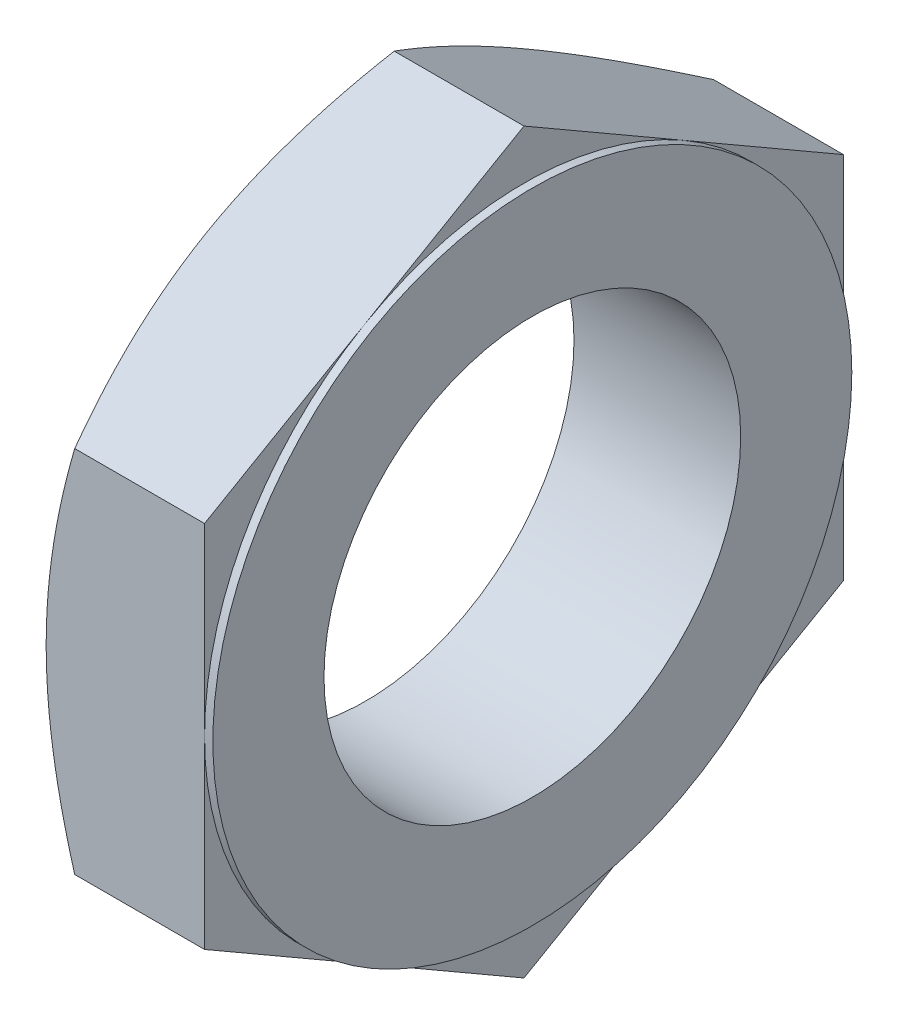
ISO-10303-21;
HEADER;
FILE_DESCRIPTION(('STEP AP214'),'2;1');
FILE_NAME('part.step','',(''),(''),'','','');
FILE_SCHEMA(('AUTOMOTIVE_DESIGN { 1 0 10303 214 1 1 1 1 }'));
ENDSEC;
DATA;
#1=APPLICATION_CONTEXT('core data for automotive mechanical design processes');
#2=APPLICATION_PROTOCOL_DEFINITION('international standard','automotive_design',2000,#1);
#3=PRODUCT_CONTEXT('',#1,'mechanical');
#4=PRODUCT('Part','Part','',(#3));
#5=PRODUCT_RELATED_PRODUCT_CATEGORY('part','',(#4));
#6=PRODUCT_DEFINITION_FORMATION('','',#4);
#7=PRODUCT_DEFINITION_CONTEXT('part definition',#1,'design');
#8=PRODUCT_DEFINITION('design','',#6,#7);
#9=PRODUCT_DEFINITION_SHAPE('','',#8);
#10=(LENGTH_UNIT() NAMED_UNIT(*) SI_UNIT(.MILLI.,.METRE.));
#11=(NAMED_UNIT(*) PLANE_ANGLE_UNIT() SI_UNIT($,.RADIAN.));
#12=(NAMED_UNIT(*) SI_UNIT($,.STERADIAN.) SOLID_ANGLE_UNIT());
#13=UNCERTAINTY_MEASURE_WITH_UNIT(LENGTH_MEASURE(1.E-05),#10,'distance_accuracy_value','');
#14=(GEOMETRIC_REPRESENTATION_CONTEXT(3) GLOBAL_UNCERTAINTY_ASSIGNED_CONTEXT((#13)) GLOBAL_UNIT_ASSIGNED_CONTEXT((#10,
#11,#12)) REPRESENTATION_CONTEXT('',''));
#15=CARTESIAN_POINT('',(0.,0.,0.));
#16=DIRECTION('',(0.,0.,1.));
#17=DIRECTION('',(1.,0.,0.));
#18=AXIS2_PLACEMENT_3D('',#15,#16,#17);
#19=CARTESIAN_POINT('',(-214.6,0.,0.));
#20=DIRECTION('',(-1.,0.,0.));
#21=DIRECTION('',(0.,0.,1.));
#22=AXIS2_PLACEMENT_3D('',#19,#20,#21);
#23=PLANE('',#22);
#24=DIRECTION('',(0.,-0.500000000000017,0.866025403784429));
#25=VECTOR('',#24,1.);
#26=CARTESIAN_POINT('',(-214.6,13.27905619136,23.));
#27=LINE('',#26,#25);
#28=CARTESIAN_POINT('',(-214.6,19.9185841370716,11.5000002597556));
#29=VERTEX_POINT('',#28);
#30=CARTESIAN_POINT('',(-214.6,26.5581123827205,2.84003214601197E-13));
#31=VERTEX_POINT('',#30);
#32=EDGE_CURVE('E108',#29,#31,#27,.F.);
#33=ORIENTED_EDGE('',*,*,#32,.F.);
#34=CARTESIAN_POINT('',(-214.6,0.,0.));
#35=DIRECTION('',(1.,0.,0.));
#36=DIRECTION('',(0.,0.,-1.));
#37=AXIS2_PLACEMENT_3D('',#34,#35,#36);
#38=CIRCLE('',#37,23.);
#39=CARTESIAN_POINT('',(-214.6,19.9185842870406,-11.5));
#40=VERTEX_POINT('',#39);
#41=EDGE_CURVE('E19',#40,#29,#38,.T.);
#42=ORIENTED_EDGE('',*,*,#41,.F.);
#43=DIRECTION('',(0.,0.500000000000017,0.866025403784429));
#44=VECTOR('',#43,1.);
#45=CARTESIAN_POINT('',(-214.6,26.55811238272,0.));
#46=LINE('',#45,#44);
#47=EDGE_CURVE('E113',#31,#40,#46,.F.);
#48=ORIENTED_EDGE('',*,*,#47,.F.);
#49=EDGE_LOOP('',(#33,#42,#48));
#50=FACE_BOUND('',#49,.T.);
#51=ADVANCED_FACE('F16',(#50),#23,.F.);
#52=CARTESIAN_POINT('',(-214.6,0.,0.));
#53=DIRECTION('',(-1.,0.,0.));
#54=DIRECTION('',(0.,0.,1.));
#55=AXIS2_PLACEMENT_3D('',#52,#53,#54);
#56=PLANE('',#55);
#57=DIRECTION('',(0.,0.500000000000017,0.866025403784429));
#58=VECTOR('',#57,1.);
#59=CARTESIAN_POINT('',(-214.6,26.55811238272,0.));
#60=LINE('',#59,#58);
#61=CARTESIAN_POINT('',(-214.6,13.2790561913595,-22.9999999999997));
#62=VERTEX_POINT('',#61);
#63=EDGE_CURVE('E111',#40,#62,#60,.F.);
#64=ORIENTED_EDGE('',*,*,#63,.F.);
#65=CARTESIAN_POINT('',(-214.6,0.,0.));
#66=DIRECTION('',(1.,0.,0.));
#67=DIRECTION('',(0.,0.,-1.));
#68=AXIS2_PLACEMENT_3D('',#65,#66,#67);
#69=CIRCLE('',#68,23.);
#70=CARTESIAN_POINT('',(-214.6,0.,-23.));
#71=VERTEX_POINT('',#70);
#72=EDGE_CURVE('E104',#71,#40,#69,.T.);
#73=ORIENTED_EDGE('',*,*,#72,.F.);
#74=DIRECTION('',(0.,1.,0.));
#75=VECTOR('',#74,1.);
#76=CARTESIAN_POINT('',(-214.6,13.27905619136,-23.));
#77=LINE('',#76,#75);
#78=EDGE_CURVE('E378',#62,#71,#77,.F.);
#79=ORIENTED_EDGE('',*,*,#78,.F.);
#80=EDGE_LOOP('',(#64,#73,#79));
#81=FACE_BOUND('',#80,.T.);
#82=ADVANCED_FACE('F281',(#81),#56,.F.);
#83=CARTESIAN_POINT('',(-214.6,0.,0.));
#84=DIRECTION('',(-1.,0.,0.));
#85=DIRECTION('',(0.,0.,1.));
#86=AXIS2_PLACEMENT_3D('',#83,#84,#85);
#87=PLANE('',#86);
#88=DIRECTION('',(0.,1.,0.));
#89=VECTOR('',#88,1.);
#90=CARTESIAN_POINT('',(-214.6,13.27905619136,-23.));
#91=LINE('',#90,#89);
#92=CARTESIAN_POINT('',(-214.6,-13.27905619136,-23.));
#93=VERTEX_POINT('',#92);
#94=EDGE_CURVE('E379',#71,#93,#91,.F.);
#95=ORIENTED_EDGE('',*,*,#94,.F.);
#96=CARTESIAN_POINT('',(-214.6,0.,0.));
#97=DIRECTION('',(1.,0.,0.));
#98=DIRECTION('',(0.,0.,-1.));
#99=AXIS2_PLACEMENT_3D('',#96,#97,#98);
#100=CIRCLE('',#99,23.);
#101=CARTESIAN_POINT('',(-214.6,-19.9185842870413,-11.5000000000004));
#102=VERTEX_POINT('',#101);
#103=EDGE_CURVE('E121',#102,#71,#100,.T.);
#104=ORIENTED_EDGE('',*,*,#103,.F.);
#105=DIRECTION('',(0.,0.500000000000017,-0.866025403784429));
#106=VECTOR('',#105,1.);
#107=CARTESIAN_POINT('',(-214.6,-13.27905619136,-23.));
#108=LINE('',#107,#106);
#109=EDGE_CURVE('E372',#93,#102,#108,.F.);
#110=ORIENTED_EDGE('',*,*,#109,.F.);
#111=EDGE_LOOP('',(#95,#104,#110));
#112=FACE_BOUND('',#111,.T.);
#113=ADVANCED_FACE('F278',(#112),#87,.F.);
#114=CARTESIAN_POINT('',(-214.6,0.,0.));
#115=DIRECTION('',(-1.,0.,0.));
#116=DIRECTION('',(0.,0.,1.));
#117=AXIS2_PLACEMENT_3D('',#114,#115,#116);
#118=PLANE('',#117);
#119=DIRECTION('',(0.,0.500000000000017,-0.866025403784429));
#120=VECTOR('',#119,1.);
#121=CARTESIAN_POINT('',(-214.6,-13.27905619136,-23.));
#122=LINE('',#121,#120);
#123=CARTESIAN_POINT('',(-214.6,-26.5581123827205,-2.84003214601197E-13));
#124=VERTEX_POINT('',#123);
#125=EDGE_CURVE('E373',#102,#124,#122,.F.);
#126=ORIENTED_EDGE('',*,*,#125,.F.);
#127=CARTESIAN_POINT('',(-214.6,0.,0.));
#128=DIRECTION('',(1.,0.,0.));
#129=DIRECTION('',(0.,0.,-1.));
#130=AXIS2_PLACEMENT_3D('',#127,#128,#129);
#131=CIRCLE('',#130,23.);
#132=CARTESIAN_POINT('',(-214.6,-19.9185842870406,11.5));
#133=VERTEX_POINT('',#132);
#134=EDGE_CURVE('E126',#133,#102,#131,.T.);
#135=ORIENTED_EDGE('',*,*,#134,.F.);
#136=DIRECTION('',(0.,-0.500000000000017,-0.866025403784429));
#137=VECTOR('',#136,1.);
#138=CARTESIAN_POINT('',(-214.6,-26.55811238272,0.));
#139=LINE('',#138,#137);
#140=EDGE_CURVE('E368',#124,#133,#139,.F.);
#141=ORIENTED_EDGE('',*,*,#140,.F.);
#142=EDGE_LOOP('',(#126,#135,#141));
#143=FACE_BOUND('',#142,.T.);
#144=ADVANCED_FACE('F275',(#143),#118,.F.);
#145=CARTESIAN_POINT('',(-214.6,0.,0.));
#146=DIRECTION('',(-1.,0.,0.));
#147=DIRECTION('',(0.,0.,1.));
#148=AXIS2_PLACEMENT_3D('',#145,#146,#147);
#149=PLANE('',#148);
#150=DIRECTION('',(0.,1.,0.));
#151=VECTOR('',#150,1.);
#152=CARTESIAN_POINT('',(-214.6,-13.27905619136,23.));
#153=LINE('',#152,#151);
#154=CARTESIAN_POINT('',(-214.6,0.,23.));
#155=VERTEX_POINT('',#154);
#156=CARTESIAN_POINT('',(-214.6,13.27905619136,23.));
#157=VERTEX_POINT('',#156);
#158=EDGE_CURVE('E100',#155,#157,#153,.T.);
#159=ORIENTED_EDGE('',*,*,#158,.F.);
#160=CARTESIAN_POINT('',(-214.6,0.,0.));
#161=DIRECTION('',(1.,0.,0.));
#162=DIRECTION('',(0.,0.,-1.));
#163=AXIS2_PLACEMENT_3D('',#160,#161,#162);
#164=CIRCLE('',#163,23.);
#165=EDGE_CURVE('E93',#29,#155,#164,.T.);
#166=ORIENTED_EDGE('',*,*,#165,.F.);
#167=DIRECTION('',(0.,-0.500000000000017,0.866025403784429));
#168=VECTOR('',#167,1.);
#169=CARTESIAN_POINT('',(-214.6,13.27905619136,23.));
#170=LINE('',#169,#168);
#171=EDGE_CURVE('E97',#157,#29,#170,.F.);
#172=ORIENTED_EDGE('',*,*,#171,.F.);
#173=EDGE_LOOP('',(#159,#166,#172));
#174=FACE_BOUND('',#173,.T.);
#175=ADVANCED_FACE('F95',(#174),#149,.F.);
#176=CARTESIAN_POINT('',(-214.6,0.,0.));
#177=DIRECTION('',(-1.,0.,0.));
#178=DIRECTION('',(0.,0.,1.));
#179=AXIS2_PLACEMENT_3D('',#176,#177,#178);
#180=PLANE('',#179);
#181=DIRECTION('',(0.,-0.500000000000017,-0.866025403784429));
#182=VECTOR('',#181,1.);
#183=CARTESIAN_POINT('',(-214.6,-26.55811238272,0.));
#184=LINE('',#183,#182);
#185=CARTESIAN_POINT('',(-214.6,-13.2790561913595,22.9999999999997));
#186=VERTEX_POINT('',#185);
#187=EDGE_CURVE('E358',#133,#186,#184,.F.);
#188=ORIENTED_EDGE('',*,*,#187,.F.);
#189=CARTESIAN_POINT('',(-214.6,0.,0.));
#190=DIRECTION('',(1.,0.,0.));
#191=DIRECTION('',(0.,0.,-1.));
#192=AXIS2_PLACEMENT_3D('',#189,#190,#191);
#193=CIRCLE('',#192,23.);
#194=EDGE_CURVE('E115',#155,#133,#193,.T.);
#195=ORIENTED_EDGE('',*,*,#194,.F.);
#196=DIRECTION('',(0.,1.,0.));
#197=VECTOR('',#196,1.);
#198=CARTESIAN_POINT('',(-214.6,-13.27905619136,23.));
#199=LINE('',#198,#197);
#200=EDGE_CURVE('E136',#186,#155,#199,.T.);
#201=ORIENTED_EDGE('',*,*,#200,.F.);
#202=EDGE_LOOP('',(#188,#195,#201));
#203=FACE_BOUND('',#202,.T.);
#204=ADVANCED_FACE('F268',(#203),#180,.F.);
#205=CARTESIAN_POINT('',(-214.6,0.,0.));
#206=DIRECTION('',(1.,0.,0.));
#207=DIRECTION('',(0.,0.,-1.));
#208=AXIS2_PLACEMENT_3D('',#205,#206,#207);
#209=CYLINDRICAL_SURFACE('',#208,23.);
#210=CARTESIAN_POINT('',(-214.,0.,0.));
#211=DIRECTION('',(1.,0.,0.));
#212=DIRECTION('',(0.,0.,-1.));
#213=AXIS2_PLACEMENT_3D('',#210,#211,#212);
#214=CIRCLE('',#213,23.);
#215=CARTESIAN_POINT('',(-214.,0.,-23.));
#216=VERTEX_POINT('',#215);
#217=EDGE_CURVE('E132',#216,#216,#214,.T.);
#218=ORIENTED_EDGE('',*,*,#217,.F.);
#219=EDGE_LOOP('',(#218));
#220=FACE_BOUND('',#219,.T.);
#221=ORIENTED_EDGE('',*,*,#103,.T.);
#222=ORIENTED_EDGE('',*,*,#72,.T.);
#223=ORIENTED_EDGE('',*,*,#41,.T.);
#224=ORIENTED_EDGE('',*,*,#165,.T.);
#225=ORIENTED_EDGE('',*,*,#194,.T.);
#226=ORIENTED_EDGE('',*,*,#134,.T.);
#227=EDGE_LOOP('',(#221,#222,#223,#224,#225,#226));
#228=FACE_BOUND('',#227,.T.);
#229=ADVANCED_FACE('F119',(#220,#228),#209,.T.);
#230=CARTESIAN_POINT('',(-214.6,13.27905619136,23.));
#231=DIRECTION('',(0.,0.866025403784429,0.500000000000017));
#232=DIRECTION('',(0.,-0.500000000000017,0.866025403784429));
#233=AXIS2_PLACEMENT_3D('',#230,#231,#232);
#234=PLANE('',#233);
#235=DIRECTION('',(1.,0.,0.));
#236=VECTOR('',#235,1.);
#237=CARTESIAN_POINT('',(-214.6,13.27905619136,23.));
#238=LINE('',#237,#236);
#239=CARTESIAN_POINT('',(-223.94572285327,13.2790561830221,23.0000000144417));
#240=VERTEX_POINT('',#239);
#241=EDGE_CURVE('E110',#157,#240,#238,.F.);
#242=ORIENTED_EDGE('',*,*,#241,.F.);
#243=ORIENTED_EDGE('',*,*,#171,.T.);
#244=ORIENTED_EDGE('',*,*,#32,.T.);
#245=DIRECTION('',(1.,0.,0.));
#246=VECTOR('',#245,1.);
#247=CARTESIAN_POINT('',(-214.6,26.55811238272,0.));
#248=LINE('',#247,#246);
#249=CARTESIAN_POINT('',(-223.945722853271,26.5581123910582,1.44421933980429E-08));
#250=VERTEX_POINT('',#249);
#251=EDGE_CURVE('E337',#250,#31,#248,.T.);
#252=ORIENTED_EDGE('',*,*,#251,.F.);
#253=CARTESIAN_POINT('',(-226.000000000053,19.9185842866265,11.500000000718));
#254=CARTESIAN_POINT('',(-226.000004290286,20.059489721746,11.2559446280284));
#255=CARTESIAN_POINT('',(-225.997009045692,20.2003907729308,11.0118968485364));
#256=CARTESIAN_POINT('',(-225.985058576553,20.4821276328057,10.5239142928682));
#257=CARTESIAN_POINT('',(-225.976103441065,20.6229634424391,10.279979515058));
#258=CARTESIAN_POINT('',(-225.940362568145,21.045225239276,9.54860062884136));
#259=CARTESIAN_POINT('',(-225.904701327172,21.3264750877552,9.06146160165425));
#260=CARTESIAN_POINT('',(-225.810740485758,21.8865969337703,8.09130210592696));
#261=CARTESIAN_POINT('',(-225.752554853244,22.1654737914888,7.60827321930339));
#262=CARTESIAN_POINT('',(-225.614760043448,22.7219027931818,6.6445099175662));
#263=CARTESIAN_POINT('',(-225.535150302267,22.9994549020923,6.16377556318541));
#264=CARTESIAN_POINT('',(-225.356140228588,23.5526055995915,5.20569045087473));
#265=CARTESIAN_POINT('',(-225.256763852706,23.8282061387326,4.72833631448893));
#266=CARTESIAN_POINT('',(-225.039843927351,24.377623129309,3.77671817226913));
#267=CARTESIAN_POINT('',(-224.92229927075,24.6514394709594,3.30245435658789));
#268=CARTESIAN_POINT('',(-224.670156349215,25.1985686467302,2.35479882584966));
#269=CARTESIAN_POINT('',(-224.535473764069,25.4718717067768,1.8814240399849));
#270=CARTESIAN_POINT('',(-224.251287292452,26.0164779181853,0.938138411707918));
#271=CARTESIAN_POINT('',(-224.101786995302,26.2877815368517,0.468226759900393));
#272=CARTESIAN_POINT('',(-223.945722883089,26.5581123394127,7.50139206661458E-08));
#273=B_SPLINE_CURVE_WITH_KNOTS('',3,(#253,#254,#255,#256,#257,#258,#259,#260,#261,#262,#263,
#264,#265,#266,#267,#268,#269,#270,#271,#272),.UNSPECIFIED.,.F.,.F.,(4,2,2,2,2,2,2,2,2,4),(0.,
0.845399486258044,1.69078634044896,3.38114342655175,5.06305721033161,6.74501526769183,
8.42494712456999,10.104981392493,11.7936266685007,13.4818638959214),.UNSPECIFIED.);
#274=CARTESIAN_POINT('',(-226.000000000062,19.9185842866129,11.5000000007101));
#275=VERTEX_POINT('',#274);
#276=EDGE_CURVE('E257',#275,#250,#273,.T.);
#277=ORIENTED_EDGE('',*,*,#276,.F.);
#278=CARTESIAN_POINT('',(-223.945722848456,13.2790561746841,23.0000000288835));
#279=CARTESIAN_POINT('',(-224.101786963072,13.5493869795776,22.531773339957));
#280=CARTESIAN_POINT('',(-224.251287262565,13.8206906005922,22.0618616840822));
#281=CARTESIAN_POINT('',(-224.535473738708,14.3652968167342,21.1185760476065));
#282=CARTESIAN_POINT('',(-224.670156326036,14.6385998791662,20.6452012576103));
#283=CARTESIAN_POINT('',(-224.922299251713,15.1857290597161,19.6975457185943));
#284=CARTESIAN_POINT('',(-225.039843910275,15.4595454037601,19.2232818987673));
#285=CARTESIAN_POINT('',(-225.256763839303,16.0089623991626,18.2716637481885));
#286=CARTESIAN_POINT('',(-225.356140216896,16.2845629407363,17.7943096075893));
#287=CARTESIAN_POINT('',(-225.535150293704,16.8377136431515,16.8362244867638));
#288=CARTESIAN_POINT('',(-225.6147600363,17.1152657545455,16.3554901280814));
#289=CARTESIAN_POINT('',(-225.752554848577,17.6716947612393,15.3917268176827));
#290=CARTESIAN_POINT('',(-225.810740482155,17.9505716214749,14.9086979266994));
#291=CARTESIAN_POINT('',(-225.904701325311,18.5106934725804,13.9385384221552));
#292=CARTESIAN_POINT('',(-225.940362566958,18.7919433236331,13.4513993905107));
#293=CARTESIAN_POINT('',(-225.976103440567,19.2142051243417,12.7200204975879));
#294=CARTESIAN_POINT('',(-225.985058576232,19.3550409352683,12.4760857175378));
#295=CARTESIAN_POINT('',(-225.997009045613,19.6367777977316,11.9881031573865));
#296=CARTESIAN_POINT('',(-226.000004290275,19.7776788502116,11.7440553756511));
#297=CARTESIAN_POINT('',(-226.000000000053,19.9185842866265,11.500000000718));
#298=B_SPLINE_CURVE_WITH_KNOTS('',3,(#278,#279,#280,#281,#282,#283,#284,#285,#286,#287,#288,
#289,#290,#291,#292,#293,#294,#295,#296,#297),.UNSPECIFIED.,.F.,.F.,(4,2,2,2,2,2,2,2,2,4),(0.,
1.6882372428676,3.37688253433479,5.05691681752872,6.73684868967513,8.41880676237987,
10.1007205615015,11.7910776631283,12.6364645250899,13.4818640191191),.UNSPECIFIED.);
#299=EDGE_CURVE('E144',#240,#275,#298,.T.);
#300=ORIENTED_EDGE('',*,*,#299,.F.);
#301=EDGE_LOOP('',(#242,#243,#244,#252,#277,#300));
#302=FACE_BOUND('',#301,.T.);
#303=ADVANCED_FACE('F107',(#302),#234,.T.);
#304=CARTESIAN_POINT('',(-214.6,26.55811238272,0.));
#305=DIRECTION('',(0.,0.866025403784429,-0.500000000000017));
#306=DIRECTION('',(0.,0.500000000000017,0.866025403784429));
#307=AXIS2_PLACEMENT_3D('',#304,#305,#306);
#308=PLANE('',#307);
#309=ORIENTED_EDGE('',*,*,#251,.T.);
#310=ORIENTED_EDGE('',*,*,#47,.T.);
#311=ORIENTED_EDGE('',*,*,#63,.T.);
#312=DIRECTION('',(-1.,0.,0.));
#313=VECTOR('',#312,1.);
#314=CARTESIAN_POINT('',(-214.6,13.27905619136,-23.));
#315=LINE('',#314,#313);
#316=CARTESIAN_POINT('',(-223.94572285327,13.2790562080359,-23.));
#317=VERTEX_POINT('',#316);
#318=EDGE_CURVE('E376',#317,#62,#315,.F.);
#319=ORIENTED_EDGE('',*,*,#318,.F.);
#320=CARTESIAN_POINT('',(-226.000000000054,19.9185845223386,-11.4999995924492));
#321=CARTESIAN_POINT('',(-226.000004293611,19.7776790822702,-11.7440549737105));
#322=CARTESIAN_POINT('',(-225.997009052129,19.6367780261191,-11.9881027618043));
#323=CARTESIAN_POINT('',(-225.985058588778,19.3550411562834,-12.4760853347251));
#324=CARTESIAN_POINT('',(-225.976103455965,19.2142053416554,-12.7200201211861));
#325=CARTESIAN_POINT('',(-225.940362590396,18.7919435298086,-13.4513990334008));
#326=CARTESIAN_POINT('',(-225.904701353425,18.5106936712813,-13.9385380779917));
#327=CARTESIAN_POINT('',(-225.810740518192,17.950571805323,-14.9086976082618));
#328=CARTESIAN_POINT('',(-225.752554887878,17.6716949377089,-15.391726512025));
#329=CARTESIAN_POINT('',(-225.614760080751,17.1152659162599,-16.3554898479804));
#330=CARTESIAN_POINT('',(-225.535150340039,16.8377137974891,-16.8362242194398));
#331=CARTESIAN_POINT('',(-225.356140265701,16.2845630803915,-17.794309365696));
#332=CARTESIAN_POINT('',(-225.256763888695,16.008962531512,-18.2716635189491));
#333=CARTESIAN_POINT('',(-225.039843959652,15.4595455215662,-19.2232816947177));
#334=CARTESIAN_POINT('',(-224.922299300487,15.1857291702847,-19.6975455270805));
#335=CARTESIAN_POINT('',(-224.670156372494,14.6385999752083,-20.645201091257));
#336=CARTESIAN_POINT('',(-224.53547378344,14.3652969054887,-21.1185758938759));
#337=CARTESIAN_POINT('',(-224.251287302913,13.8206906748799,-22.0618615554088));
#338=CARTESIAN_POINT('',(-224.101787000762,13.5493870466861,-22.5317732237182));
#339=CARTESIAN_POINT('',(-223.945722883089,13.2790562346674,-22.9999999249859));
#340=B_SPLINE_CURVE_WITH_KNOTS('',3,(#320,#321,#322,#323,#324,#325,#326,#327,#328,#329,#330,
#331,#332,#333,#334,#335,#336,#337,#338,#339),.UNSPECIFIED.,.F.,.F.,(4,2,2,2,2,2,2,2,2,4),(0.,
0.845399515948435,1.69078639983034,3.38114354527786,5.06305738737292,6.74501550304667,
8.42494741798524,10.1049817439879,11.7936270791279,13.4818643656172),.UNSPECIFIED.);
#341=CARTESIAN_POINT('',(-226.000000000063,19.9185845223258,-11.4999995924418));
#342=VERTEX_POINT('',#341);
#343=EDGE_CURVE('E238',#342,#317,#340,.T.);
#344=ORIENTED_EDGE('',*,*,#343,.F.);
#345=CARTESIAN_POINT('',(-223.945722848457,26.5581123993964,2.88843867869388E-08));
#346=CARTESIAN_POINT('',(-224.101786957614,26.2877816039606,-0.46822664366087));
#347=CARTESIAN_POINT('',(-224.251287252105,26.0164779924733,-0.93813828303377));
#348=CARTESIAN_POINT('',(-224.535473719338,25.4718717955316,-1.88142388625363));
#349=CARTESIAN_POINT('',(-224.670156302759,25.1985687427727,-2.35479865949578));
#350=CARTESIAN_POINT('',(-224.922299221978,24.6514395815283,-3.30245416507356));
#351=CARTESIAN_POINT('',(-225.039843877976,24.3776232471153,-3.77671796821904));
#352=CARTESIAN_POINT('',(-225.256763803316,23.8282062710823,-4.72833608524911));
#353=CARTESIAN_POINT('',(-225.356140179784,23.5526057392469,-5.20569020898098));
#354=CARTESIAN_POINT('',(-225.535150255933,22.9994550564301,-6.16377529586109));
#355=CARTESIAN_POINT('',(-225.614759999,22.7219029548964,-6.64450963746496));
#356=CARTESIAN_POINT('',(-225.752554813945,22.1654739679585,-7.60827291364538));
#357=CARTESIAN_POINT('',(-225.810740449722,21.8865971176185,-8.09130178748909));
#358=CARTESIAN_POINT('',(-225.90470129906,21.3264752864563,-9.06146125749052));
#359=CARTESIAN_POINT('',(-225.940362544708,21.0452254454515,-9.5486002717314));
#360=CARTESIAN_POINT('',(-225.976103425668,20.6229636597529,-10.2799791386561));
#361=CARTESIAN_POINT('',(-225.985058564009,20.4821278538208,-10.5239139100554));
#362=CARTESIAN_POINT('',(-225.997009039178,20.2003910013183,-11.0118964529542));
#363=CARTESIAN_POINT('',(-226.000004286952,20.0594899538045,-11.2559442260877));
#364=CARTESIAN_POINT('',(-226.000000000054,19.9185845223386,-11.4999995924492));
#365=B_SPLINE_CURVE_WITH_KNOTS('',3,(#345,#346,#347,#348,#349,#350,#351,#352,#353,#354,#355,
#356,#357,#358,#359,#360,#361,#362,#363,#364),.UNSPECIFIED.,.F.,.F.,(4,2,2,2,2,2,2,2,2,4),(0.,
1.68823718379916,3.37688241613418,5.05691664124849,6.73684845533462,8.41880646972595,
10.1007202105325,11.7910772528147,12.6364640850853,13.4818635494242),.UNSPECIFIED.);
#366=EDGE_CURVE('E253',#250,#342,#365,.T.);
#367=ORIENTED_EDGE('',*,*,#366,.F.);
#368=EDGE_LOOP('',(#309,#310,#311,#319,#344,#367));
#369=FACE_BOUND('',#368,.T.);
#370=ADVANCED_FACE('F223',(#369),#308,.T.);
#371=CARTESIAN_POINT('',(-214.6,13.27905619136,-23.));
#372=DIRECTION('',(0.,0.,-1.));
#373=DIRECTION('',(-1.,0.,0.));
#374=AXIS2_PLACEMENT_3D('',#371,#372,#373);
#375=PLANE('',#374);
#376=ORIENTED_EDGE('',*,*,#318,.T.);
#377=ORIENTED_EDGE('',*,*,#78,.T.);
#378=ORIENTED_EDGE('',*,*,#94,.T.);
#379=DIRECTION('',(1.,0.,0.));
#380=VECTOR('',#379,1.);
#381=CARTESIAN_POINT('',(-214.6,-13.27905619136,-23.));
#382=LINE('',#381,#380);
#383=CARTESIAN_POINT('',(-223.94572285327,-13.279056183022,-23.0000000144418));
#384=VERTEX_POINT('',#383);
#385=EDGE_CURVE('E351',#384,#93,#382,.T.);
#386=ORIENTED_EDGE('',*,*,#385,.F.);
#387=CARTESIAN_POINT('',(-226.000000000053,0.,-23.));
#388=CARTESIAN_POINT('',(-226.00000429028,-0.281810870221517,-23.));
#389=CARTESIAN_POINT('',(-225.99700904568,-0.563612972573665,-23.));
#390=CARTESIAN_POINT('',(-225.985058576531,-1.12708669228818,-23.));
#391=CARTESIAN_POINT('',(-225.976103441038,-1.40875831153736,-23.));
#392=CARTESIAN_POINT('',(-225.940362568105,-2.25328190515794,-23.));
#393=CARTESIAN_POINT('',(-225.904701327125,-2.81578160208095,-23.));
#394=CARTESIAN_POINT('',(-225.8107404857,-3.93602529404053,-23.));
#395=CARTESIAN_POINT('',(-225.752554853182,-4.49377900944254,-23.));
#396=CARTESIAN_POINT('',(-225.614760043382,-5.60663701275885,-23.));
#397=CARTESIAN_POINT('',(-225.5351503022,-6.1617412305449,-23.));
#398=CARTESIAN_POINT('',(-225.356140228522,-7.26804262547395,-23.));
#399=CARTESIAN_POINT('',(-225.256763852642,-7.81924370372179,-23.));
#400=CARTESIAN_POINT('',(-225.039843927294,-8.91807768480603,-23.));
#401=CARTESIAN_POINT('',(-224.922299270697,-9.46571036807293,-23.));
#402=CARTESIAN_POINT('',(-224.670156349173,-10.5599687195462,-23.));
#403=CARTESIAN_POINT('',(-224.535473764034,-11.1065748396053,-23.));
#404=CARTESIAN_POINT('',(-224.251287292433,-12.1957872623543,-23.));
#405=CARTESIAN_POINT('',(-224.101786995292,-12.7383944996535,-23.));
#406=CARTESIAN_POINT('',(-223.945722883088,-13.279056104742,-23.));
#407=B_SPLINE_CURVE_WITH_KNOTS('',3,(#387,#388,#389,#390,#391,#392,#393,#394,#395,#396,#397,
#398,#399,#400,#401,#402,#403,#404,#405,#406),.UNSPECIFIED.,.F.,.F.,(4,2,2,2,2,2,2,2,2,4),(0.,
0.845399486205587,1.69078634034405,3.38114342634199,5.06305721001881,6.745015267276,
8.42494712405157,10.1049813918719,11.7936266677752,13.4818638950915),.UNSPECIFIED.);
#408=CARTESIAN_POINT('',(-226.000000000062,0.,-22.9999999999839));
#409=VERTEX_POINT('',#408);
#410=EDGE_CURVE('E227',#409,#384,#407,.T.);
#411=ORIENTED_EDGE('',*,*,#410,.F.);
#412=CARTESIAN_POINT('',(-223.945722848456,13.2790562247118,-23.));
#413=CARTESIAN_POINT('',(-224.101786963082,12.7383946148915,-23.));
#414=CARTESIAN_POINT('',(-224.251287262584,12.1957873728287,-23.));
#415=CARTESIAN_POINT('',(-224.535473738742,11.1065749404771,-23.));
#416=CARTESIAN_POINT('',(-224.670156326077,10.5599688155792,-23.));
#417=CARTESIAN_POINT('',(-224.922299251765,9.46571045441128,-23.));
#418=CARTESIAN_POINT('',(-225.039843910332,8.91807776628935,-23.));
#419=CARTESIAN_POINT('',(-225.256763839366,7.81924377541621,-23.));
#420=CARTESIAN_POINT('',(-225.356140216961,7.26804269223452,-23.));
#421=CARTESIAN_POINT('',(-225.53515029377,6.1617412873351,-23.));
#422=CARTESIAN_POINT('',(-225.614760036366,5.60663706451232,-23.));
#423=CARTESIAN_POINT('',(-225.752554848637,4.49377905105524,-23.));
#424=CARTESIAN_POINT('',(-225.810740482212,3.9360253305492,-23.));
#425=CARTESIAN_POINT('',(-225.904701325357,2.81578162826801,-23.));
#426=CARTESIAN_POINT('',(-225.940362566997,2.25328192612707,-23.));
#427=CARTESIAN_POINT('',(-225.976103440593,1.40875832465708,-23.));
#428=CARTESIAN_POINT('',(-225.985058576253,1.12708670278624,-23.));
#429=CARTESIAN_POINT('',(-225.997009045624,0.563612977824671,-23.));
#430=CARTESIAN_POINT('',(-226.00000429028,0.281810872847144,-23.));
#431=CARTESIAN_POINT('',(-226.000000000053,0.,-23.));
#432=B_SPLINE_CURVE_WITH_KNOTS('',3,(#412,#413,#414,#415,#416,#417,#418,#419,#420,#421,#422,
#423,#424,#425,#426,#427,#428,#429,#430,#431),.UNSPECIFIED.,.F.,.F.,(4,2,2,2,2,2,2,2,2,4),(0.,
1.68823724297163,3.37688253454297,5.0569168178392,6.73684869008788,8.41880676289533,
10.1007205621197,11.791077663851,12.6364645258648,13.4818640199464),.UNSPECIFIED.);
#433=EDGE_CURVE('E232',#317,#409,#432,.T.);
#434=ORIENTED_EDGE('',*,*,#433,.F.);
#435=EDGE_LOOP('',(#376,#377,#378,#386,#411,#434));
#436=FACE_BOUND('',#435,.T.);
#437=ADVANCED_FACE('F217',(#436),#375,.T.);
#438=CARTESIAN_POINT('',(-214.6,-13.27905619136,-23.));
#439=DIRECTION('',(0.,-0.866025403784429,-0.500000000000017));
#440=DIRECTION('',(0.,0.500000000000017,-0.866025403784429));
#441=AXIS2_PLACEMENT_3D('',#438,#439,#440);
#442=PLANE('',#441);
#443=ORIENTED_EDGE('',*,*,#385,.T.);
#444=ORIENTED_EDGE('',*,*,#109,.T.);
#445=ORIENTED_EDGE('',*,*,#125,.T.);
#446=DIRECTION('',(1.,0.,0.));
#447=VECTOR('',#446,1.);
#448=CARTESIAN_POINT('',(-214.6,-26.55811238272,0.));
#449=LINE('',#448,#447);
#450=CARTESIAN_POINT('',(-223.945722853271,-26.5581123910582,-1.44421130108026E-08));
#451=VERTEX_POINT('',#450);
#452=EDGE_CURVE('E354',#451,#124,#449,.T.);
#453=ORIENTED_EDGE('',*,*,#452,.F.);
#454=CARTESIAN_POINT('',(-226.000000000053,-19.9185841281085,-11.5000002752791));
#455=CARTESIAN_POINT('',(-226.000004292529,-20.0594895665679,-11.2559448968047));
#456=CARTESIAN_POINT('',(-225.997009050035,-20.2003906211044,-11.0118971115075));
#457=CARTESIAN_POINT('',(-225.985058584803,-20.4821274877015,-10.523914544196));
#458=CARTESIAN_POINT('',(-225.97610345112,-20.6229633007056,-10.2799797605477));
#459=CARTESIAN_POINT('',(-225.940362583161,-21.0452251076723,-9.54860085678551));
#460=CARTESIAN_POINT('',(-225.904701344889,-21.3264749629328,-9.06146181785305));
#461=CARTESIAN_POINT('',(-225.810740507646,-21.8865968224071,-8.09130229881367));
#462=CARTESIAN_POINT('',(-225.752554876617,-22.1654736868038,-7.60827340062297));
#463=CARTESIAN_POINT('',(-225.614760068622,-22.7219027018297,-6.64451007579271));
#464=CARTESIAN_POINT('',(-225.535150327758,-22.9994548173947,-6.16377570988598));
#465=CARTESIAN_POINT('',(-225.356140253634,-23.5526055281203,-5.20569057466636));
#466=CARTESIAN_POINT('',(-225.256763876994,-23.8282060738336,-4.72833642689724));
#467=CARTESIAN_POINT('',(-225.039843949149,-24.3776230774819,-3.77671826203614));
#468=CARTESIAN_POINT('',(-224.922299290818,-24.6514394256322,-3.30245443509697));
#469=CARTESIAN_POINT('',(-224.670156364925,-25.1985686144318,-2.35479888179208));
#470=CARTESIAN_POINT('',(-224.535473777142,-25.4718716810065,-1.88142408462035));
#471=CARTESIAN_POINT('',(-224.251287299511,-26.0164779053728,-0.938138433899779));
#472=CARTESIAN_POINT('',(-224.101786998986,-26.287781530469,-0.468226770955509));
#473=CARTESIAN_POINT('',(-223.945722883089,-26.5581123394128,-7.50137650346872E-08));
#474=B_SPLINE_CURVE_WITH_KNOTS('',3,(#454,#455,#456,#457,#458,#459,#460,#461,#462,#463,#464,
#465,#466,#467,#468,#469,#470,#471,#472,#473),.UNSPECIFIED.,.F.,.F.,(4,2,2,2,2,2,2,2,2,4),(0.,
0.845399506295354,1.69078638052398,3.38114350667707,5.06305732981242,6.745015426527,
8.42494732258868,10.1049816297082,11.7936269456229,13.4818642129075),.UNSPECIFIED.);
#475=CARTESIAN_POINT('',(-226.000000000062,-19.9185841280949,-11.5000002752713));
#476=VERTEX_POINT('',#475);
#477=EDGE_CURVE('E202',#476,#451,#474,.T.);
#478=ORIENTED_EDGE('',*,*,#477,.F.);
#479=CARTESIAN_POINT('',(-223.945722848456,-13.2790561746841,-23.0000000288836));
#480=CARTESIAN_POINT('',(-224.101786959388,-13.5493869731948,-22.5317733510124));
#481=CARTESIAN_POINT('',(-224.251287255506,-13.8206905877796,-22.0618617062743));
#482=CARTESIAN_POINT('',(-224.535473725635,-14.3652967909638,-21.1185760922422));
#483=CARTESIAN_POINT('',(-224.670156310326,-14.6385998468677,-20.6452013135529));
#484=CARTESIAN_POINT('',(-224.922299231645,-15.1857290143888,-19.6975457971035));
#485=CARTESIAN_POINT('',(-225.039843888476,-15.459545351933,-19.2232819885345));
#486=CARTESIAN_POINT('',(-225.256763815015,-16.0089623342635,-18.2716638605969));
#487=CARTESIAN_POINT('',(-225.356140191849,-16.2845628692651,-17.7943097313811));
#488=CARTESIAN_POINT('',(-225.535150268213,-16.8377135584538,-16.8362246334645));
#489=CARTESIAN_POINT('',(-225.614760011126,-17.1152656631933,-16.355490286308));
#490=CARTESIAN_POINT('',(-225.752554825204,-17.6716946565543,-15.3917269990024));
#491=CARTESIAN_POINT('',(-225.810740460266,-17.9505715101117,-14.9086981195862));
#492=CARTESIAN_POINT('',(-225.904701307594,-18.5106933477579,-13.9385386383541));
#493=CARTESIAN_POINT('',(-225.940362551941,-18.7919431920295,-13.4513996184548));
#494=CARTESIAN_POINT('',(-225.976103430512,-19.2142049826082,-12.7200207430775));
#495=CARTESIAN_POINT('',(-225.985058567982,-19.3550407901642,-12.4760859688657));
#496=CARTESIAN_POINT('',(-225.99700904127,-19.6367776459051,-11.9881034203576));
#497=CARTESIAN_POINT('',(-226.000004288032,-19.7776786950335,-11.7440556444275));
#498=CARTESIAN_POINT('',(-226.000000000053,-19.9185841281085,-11.5000002752791));
#499=B_SPLINE_CURVE_WITH_KNOTS('',3,(#479,#480,#481,#482,#483,#484,#485,#486,#487,#488,#489,
#490,#491,#492,#493,#494,#495,#496,#497,#498),.UNSPECIFIED.,.F.,.F.,(4,2,2,2,2,2,2,2,2,4),(0.,
1.68823720300372,3.37688245456404,5.05691669856144,6.73684853152435,8.41880656487477,
10.100720324641,11.7910773862175,12.6364642281413,13.4818637021333),.UNSPECIFIED.);
#500=EDGE_CURVE('E208',#384,#476,#499,.T.);
#501=ORIENTED_EDGE('',*,*,#500,.F.);
#502=EDGE_LOOP('',(#443,#444,#445,#453,#478,#501));
#503=FACE_BOUND('',#502,.T.);
#504=ADVANCED_FACE('F213',(#503),#442,.T.);
#505=CARTESIAN_POINT('',(-214.6,-26.55811238272,0.));
#506=DIRECTION('',(0.,-0.866025403784429,0.500000000000017));
#507=DIRECTION('',(0.,-0.500000000000017,-0.866025403784429));
#508=AXIS2_PLACEMENT_3D('',#505,#506,#507);
#509=PLANE('',#508);
#510=ORIENTED_EDGE('',*,*,#452,.T.);
#511=ORIENTED_EDGE('',*,*,#140,.T.);
#512=ORIENTED_EDGE('',*,*,#187,.T.);
#513=DIRECTION('',(1.,0.,0.));
#514=VECTOR('',#513,1.);
#515=CARTESIAN_POINT('',(-214.6,-13.27905619136,23.));
#516=LINE('',#515,#514);
#517=CARTESIAN_POINT('',(-223.94572285327,-13.2790562080358,23.));
#518=VERTEX_POINT('',#517);
#519=EDGE_CURVE('E335',#518,#186,#516,.T.);
#520=ORIENTED_EDGE('',*,*,#519,.F.);
#521=CARTESIAN_POINT('',(-226.000000000054,-19.9185846817099,11.4999993164099));
#522=CARTESIAN_POINT('',(-226.000004295866,-19.7776792382836,11.7440547034873));
#523=CARTESIAN_POINT('',(-225.997009056496,-19.6367781787629,11.9881024974175));
#524=CARTESIAN_POINT('',(-225.985058597072,-19.3550413021687,12.4760850820443));
#525=CARTESIAN_POINT('',(-225.976103466075,-19.2142054841519,12.7200198743749));
#526=CARTESIAN_POINT('',(-225.940362605494,-18.7919436621207,13.4513988042296));
#527=CARTESIAN_POINT('',(-225.904701371238,-18.5106937967757,13.938537860629));
#528=CARTESIAN_POINT('',(-225.810740540199,-17.9505719172857,14.9086974143367));
#529=CARTESIAN_POINT('',(-225.752554911377,-17.6716950429574,15.3917263297293));
#530=CARTESIAN_POINT('',(-225.614760106061,-17.1152660081038,16.3554896889021));
#531=CARTESIAN_POINT('',(-225.535150365668,-16.8377138826427,16.8362240719495));
#532=CARTESIAN_POINT('',(-225.356140290882,-16.2845631522474,17.7943092412379));
#533=CARTESIAN_POINT('',(-225.256763913113,-16.0089625967604,18.2716634059356));
#534=CARTESIAN_POINT('',(-225.039843981568,-15.4595455736723,19.2232816044674));
#535=CARTESIAN_POINT('',(-224.922299320663,-15.1857292158559,19.6975454481487));
#536=CARTESIAN_POINT('',(-224.670156388288,-14.6386000076806,20.6452010350134));
#537=CARTESIAN_POINT('',(-224.535473796584,-14.3652969313977,21.1185758490001));
#538=CARTESIAN_POINT('',(-224.251287310011,-13.8206906877614,22.0618615330974));
#539=CARTESIAN_POINT('',(-224.101787004466,-13.5493870531032,22.5317732126035));
#540=CARTESIAN_POINT('',(-223.945722883089,-13.2790562346674,22.999999924986));
#541=B_SPLINE_CURVE_WITH_KNOTS('',3,(#521,#522,#523,#524,#525,#526,#527,#528,#529,#530,#531,
#532,#533,#534,#535,#536,#537,#538,#539,#540),.UNSPECIFIED.,.F.,.F.,(4,2,2,2,2,2,2,2,2,4),(0.,
0.845399536093606,1.69078644012108,3.38114362583449,5.0630575074969,6.74501566273686,
8.42494761706988,10.1049819824801,11.7936273577419,13.4818646843096),.UNSPECIFIED.);
#542=CARTESIAN_POINT('',(-226.000000000063,-19.9185846816971,11.4999993164025));
#543=VERTEX_POINT('',#542);
#544=EDGE_CURVE('E34',#543,#518,#541,.T.);
#545=ORIENTED_EDGE('',*,*,#544,.F.);
#546=CARTESIAN_POINT('',(-223.945722848457,-26.5581123993963,-2.8884224215398E-08));
#547=CARTESIAN_POINT('',(-224.10178695391,-26.2877816103777,0.468226632546244));
#548=CARTESIAN_POINT('',(-224.251287245008,-26.0164780053548,0.938138260722443));
#549=CARTESIAN_POINT('',(-224.535473706195,-25.4718718214406,1.88142384137789));
#550=CARTESIAN_POINT('',(-224.670156286964,-25.1985687752449,2.35479860325222));
#551=CARTESIAN_POINT('',(-224.922299201801,-24.6514396270995,3.30245408614185));
#552=CARTESIAN_POINT('',(-225.03984385606,-24.3776232992214,3.77671787796879));
#553=CARTESIAN_POINT('',(-225.256763778897,-23.8282063363306,4.72833597223569));
#554=CARTESIAN_POINT('',(-225.356140154603,-23.5526058111028,5.20569008452295));
#555=CARTESIAN_POINT('',(-225.535150230305,-22.9994551415836,6.16377514837078));
#556=CARTESIAN_POINT('',(-225.61475997369,-22.7219030467403,6.64450947838665));
#557=CARTESIAN_POINT('',(-225.752554790446,-22.165474073207,7.60827273134969));
#558=CARTESIAN_POINT('',(-225.810740427716,-21.8865972295812,8.09130159356401));
#559=CARTESIAN_POINT('',(-225.904701281248,-21.3264754119506,9.06146104012785));
#560=CARTESIAN_POINT('',(-225.940362529611,-21.0452255777636,9.54860004256015));
#561=CARTESIAN_POINT('',(-225.976103415559,-20.6229638022494,10.2799788918449));
#562=CARTESIAN_POINT('',(-225.985058555715,-20.4821279997061,10.5239136573746));
#563=CARTESIAN_POINT('',(-225.997009034811,-20.2003911539621,11.0118961885674));
#564=CARTESIAN_POINT('',(-226.000004284697,-20.059490109818,11.2559439558645));
#565=CARTESIAN_POINT('',(-226.000000000054,-19.9185846817099,11.4999993164099));
#566=B_SPLINE_CURVE_WITH_KNOTS('',3,(#546,#547,#548,#549,#550,#551,#552,#553,#554,#555,#556,
#557,#558,#559,#560,#561,#562,#563,#564,#565),.UNSPECIFIED.,.F.,.F.,(4,2,2,2,2,2,2,2,2,4),(0.,
1.68823714372064,3.37688233593392,5.05691652164067,6.73684829633231,8.41880627115743,
10.1007199723966,11.7910769744129,12.6364637865379,13.4818632307317),.UNSPECIFIED.);
#567=EDGE_CURVE('E197',#451,#543,#566,.T.);
#568=ORIENTED_EDGE('',*,*,#567,.F.);
#569=EDGE_LOOP('',(#510,#511,#512,#520,#545,#568));
#570=FACE_BOUND('',#569,.T.);
#571=ADVANCED_FACE('F159',(#570),#509,.T.);
#572=CARTESIAN_POINT('',(-214.6,-13.27905619136,23.));
#573=DIRECTION('',(0.,0.,1.));
#574=DIRECTION('',(1.,0.,0.));
#575=AXIS2_PLACEMENT_3D('',#572,#573,#574);
#576=PLANE('',#575);
#577=ORIENTED_EDGE('',*,*,#519,.T.);
#578=ORIENTED_EDGE('',*,*,#200,.T.);
#579=ORIENTED_EDGE('',*,*,#158,.T.);
#580=ORIENTED_EDGE('',*,*,#241,.T.);
#581=CARTESIAN_POINT('',(-226.000000000053,0.,23.));
#582=CARTESIAN_POINT('',(-226.00000429028,0.281810870221519,23.));
#583=CARTESIAN_POINT('',(-225.99700904568,0.563612972573669,23.));
#584=CARTESIAN_POINT('',(-225.985058576531,1.12708669228819,23.));
#585=CARTESIAN_POINT('',(-225.976103441038,1.40875831153737,23.));
#586=CARTESIAN_POINT('',(-225.940362568105,2.25328190515796,23.));
#587=CARTESIAN_POINT('',(-225.904701327125,2.81578160208096,23.));
#588=CARTESIAN_POINT('',(-225.8107404857,3.93602529404055,23.));
#589=CARTESIAN_POINT('',(-225.752554853182,4.49377900944256,23.));
#590=CARTESIAN_POINT('',(-225.614760043382,5.60663701275888,23.));
#591=CARTESIAN_POINT('',(-225.5351503022,6.16174123054494,23.));
#592=CARTESIAN_POINT('',(-225.356140228522,7.26804262547399,23.));
#593=CARTESIAN_POINT('',(-225.256763852642,7.81924370372184,23.));
#594=CARTESIAN_POINT('',(-225.039843927294,8.91807768480608,23.));
#595=CARTESIAN_POINT('',(-224.922299270697,9.46571036807299,23.));
#596=CARTESIAN_POINT('',(-224.670156349173,10.5599687195463,23.));
#597=CARTESIAN_POINT('',(-224.535473764034,11.1065748396053,23.));
#598=CARTESIAN_POINT('',(-224.251287292433,12.1957872623544,23.));
#599=CARTESIAN_POINT('',(-224.101786995292,12.7383944996535,23.));
#600=CARTESIAN_POINT('',(-223.945722883088,13.2790561047421,23.));
#601=B_SPLINE_CURVE_WITH_KNOTS('',3,(#581,#582,#583,#584,#585,#586,#587,#588,#589,#590,#591,
#592,#593,#594,#595,#596,#597,#598,#599,#600),.UNSPECIFIED.,.F.,.F.,(4,2,2,2,2,2,2,2,2,4),(0.,
0.845399486205592,1.69078634034406,3.38114342634201,5.06305721001884,6.74501526727604,
8.42494712405162,10.104981391872,11.7936266677752,13.4818638950916),.UNSPECIFIED.);
#602=CARTESIAN_POINT('',(-226.000000000062,0.,22.9999999999839));
#603=VERTEX_POINT('',#602);
#604=EDGE_CURVE('E135',#603,#240,#601,.T.);
#605=ORIENTED_EDGE('',*,*,#604,.F.);
#606=CARTESIAN_POINT('',(-223.945722848456,-13.2790562247117,23.));
#607=CARTESIAN_POINT('',(-224.101786963082,-12.7383946148915,23.));
#608=CARTESIAN_POINT('',(-224.251287262584,-12.1957873728286,23.));
#609=CARTESIAN_POINT('',(-224.535473738742,-11.106574940477,23.));
#610=CARTESIAN_POINT('',(-224.670156326077,-10.5599688155791,23.));
#611=CARTESIAN_POINT('',(-224.922299251765,-9.46571045441121,23.));
#612=CARTESIAN_POINT('',(-225.039843910332,-8.91807776628928,23.));
#613=CARTESIAN_POINT('',(-225.256763839366,-7.81924377541615,23.));
#614=CARTESIAN_POINT('',(-225.356140216961,-7.26804269223446,23.));
#615=CARTESIAN_POINT('',(-225.53515029377,-6.16174128733505,23.));
#616=CARTESIAN_POINT('',(-225.614760036366,-5.60663706451228,23.));
#617=CARTESIAN_POINT('',(-225.752554848637,-4.49377905105521,23.));
#618=CARTESIAN_POINT('',(-225.810740482212,-3.93602533054916,23.));
#619=CARTESIAN_POINT('',(-225.904701325357,-2.81578162826799,23.));
#620=CARTESIAN_POINT('',(-225.940362566997,-2.25328192612705,23.));
#621=CARTESIAN_POINT('',(-225.976103440593,-1.40875832465707,23.));
#622=CARTESIAN_POINT('',(-225.985058576253,-1.12708670278622,23.));
#623=CARTESIAN_POINT('',(-225.997009045624,-0.563612977824664,23.));
#624=CARTESIAN_POINT('',(-226.00000429028,-0.281810872847139,23.));
#625=CARTESIAN_POINT('',(-226.000000000053,0.,23.));
#626=B_SPLINE_CURVE_WITH_KNOTS('',3,(#606,#607,#608,#609,#610,#611,#612,#613,#614,#615,#616,
#617,#618,#619,#620,#621,#622,#623,#624,#625),.UNSPECIFIED.,.F.,.F.,(4,2,2,2,2,2,2,2,2,4),(0.,
1.68823724297161,3.37688253454294,5.05691681783915,6.73684869008782,8.41880676289526,
10.1007205621196,11.7910776638509,12.6364645258647,13.4818640199463),.UNSPECIFIED.);
#627=EDGE_CURVE('E165',#518,#603,#626,.T.);
#628=ORIENTED_EDGE('',*,*,#627,.F.);
#629=EDGE_LOOP('',(#577,#578,#579,#580,#605,#628));
#630=FACE_BOUND('',#629,.T.);
#631=ADVANCED_FACE('F154',(#630),#576,.T.);
#632=CARTESIAN_POINT('',(-214.,0.,0.));
#633=DIRECTION('',(1.,0.,0.));
#634=DIRECTION('',(0.,0.,-1.));
#635=AXIS2_PLACEMENT_3D('',#632,#633,#634);
#636=PLANE('',#635);
#637=CARTESIAN_POINT('',(-214.,0.,0.));
#638=DIRECTION('',(-1.,0.,0.));
#639=DIRECTION('',(0.,0.,1.));
#640=AXIS2_PLACEMENT_3D('',#637,#638,#639);
#641=CIRCLE('',#640,15.);
#642=CARTESIAN_POINT('',(-214.,0.,15.));
#643=VERTEX_POINT('',#642);
#644=EDGE_CURVE('E173',#643,#643,#641,.T.);
#645=ORIENTED_EDGE('',*,*,#644,.T.);
#646=EDGE_LOOP('',(#645));
#647=FACE_BOUND('',#646,.T.);
#648=ORIENTED_EDGE('',*,*,#217,.T.);
#649=EDGE_LOOP('',(#648));
#650=FACE_BOUND('',#649,.T.);
#651=ADVANCED_FACE('F158',(#647,#650),#636,.T.);
#652=CARTESIAN_POINT('',(-223.93339719531,0.,0.));
#653=DIRECTION('',(1.,0.,0.));
#654=DIRECTION('',(0.,0.,-1.));
#655=AXIS2_PLACEMENT_3D('',#652,#653,#654);
#656=CONICAL_SURFACE('',#655,26.5794610568832,1.04719755119721);
#657=ORIENTED_EDGE('',*,*,#604,.T.);
#658=ORIENTED_EDGE('',*,*,#299,.T.);
#659=CARTESIAN_POINT('',(-226.000000000071,0.,0.));
#660=DIRECTION('',(1.,0.,0.));
#661=DIRECTION('',(0.,0.,-1.));
#662=AXIS2_PLACEMENT_3D('',#659,#660,#661);
#663=CIRCLE('',#662,22.9999999999677);
#664=EDGE_CURVE('E315',#603,#275,#663,.F.);
#665=ORIENTED_EDGE('',*,*,#664,.F.);
#666=EDGE_LOOP('',(#657,#658,#665));
#667=FACE_BOUND('',#666,.T.);
#668=ADVANCED_FACE('F150',(#667),#656,.T.);
#669=CARTESIAN_POINT('',(-223.93339719531,0.,0.));
#670=DIRECTION('',(1.,0.,0.));
#671=DIRECTION('',(0.,0.,-1.));
#672=AXIS2_PLACEMENT_3D('',#669,#670,#671);
#673=CONICAL_SURFACE('',#672,26.5794610568832,1.04719755119721);
#674=ORIENTED_EDGE('',*,*,#276,.T.);
#675=ORIENTED_EDGE('',*,*,#366,.T.);
#676=CARTESIAN_POINT('',(-226.000000000071,0.,0.));
#677=DIRECTION('',(1.,0.,0.));
#678=DIRECTION('',(0.,0.,-1.));
#679=AXIS2_PLACEMENT_3D('',#676,#677,#678);
#680=CIRCLE('',#679,22.9999999999677);
#681=EDGE_CURVE('E313',#275,#342,#680,.F.);
#682=ORIENTED_EDGE('',*,*,#681,.F.);
#683=EDGE_LOOP('',(#674,#675,#682));
#684=FACE_BOUND('',#683,.T.);
#685=ADVANCED_FACE('F246',(#684),#673,.T.);
#686=CARTESIAN_POINT('',(-223.93339719531,0.,0.));
#687=DIRECTION('',(1.,0.,0.));
#688=DIRECTION('',(0.,0.,-1.));
#689=AXIS2_PLACEMENT_3D('',#686,#687,#688);
#690=CONICAL_SURFACE('',#689,26.5794610568832,1.04719755119721);
#691=ORIENTED_EDGE('',*,*,#343,.T.);
#692=ORIENTED_EDGE('',*,*,#433,.T.);
#693=CARTESIAN_POINT('',(-226.000000000071,0.,0.));
#694=DIRECTION('',(1.,0.,0.));
#695=DIRECTION('',(0.,0.,-1.));
#696=AXIS2_PLACEMENT_3D('',#693,#694,#695);
#697=CIRCLE('',#696,22.9999999999677);
#698=EDGE_CURVE('E309',#342,#409,#697,.F.);
#699=ORIENTED_EDGE('',*,*,#698,.F.);
#700=EDGE_LOOP('',(#691,#692,#699));
#701=FACE_BOUND('',#700,.T.);
#702=ADVANCED_FACE('F243',(#701),#690,.T.);
#703=CARTESIAN_POINT('',(-223.93339719531,0.,0.));
#704=DIRECTION('',(1.,0.,0.));
#705=DIRECTION('',(0.,0.,-1.));
#706=AXIS2_PLACEMENT_3D('',#703,#704,#705);
#707=CONICAL_SURFACE('',#706,26.5794610568832,1.04719755119721);
#708=ORIENTED_EDGE('',*,*,#410,.T.);
#709=ORIENTED_EDGE('',*,*,#500,.T.);
#710=CARTESIAN_POINT('',(-226.000000000071,0.,0.));
#711=DIRECTION('',(1.,0.,0.));
#712=DIRECTION('',(0.,0.,-1.));
#713=AXIS2_PLACEMENT_3D('',#710,#711,#712);
#714=CIRCLE('',#713,22.9999999999677);
#715=EDGE_CURVE('E306',#409,#476,#714,.F.);
#716=ORIENTED_EDGE('',*,*,#715,.F.);
#717=EDGE_LOOP('',(#708,#709,#716));
#718=FACE_BOUND('',#717,.T.);
#719=ADVANCED_FACE('F192',(#718),#707,.T.);
#720=CARTESIAN_POINT('',(-223.93339719531,0.,0.));
#721=DIRECTION('',(1.,0.,0.));
#722=DIRECTION('',(0.,0.,-1.));
#723=AXIS2_PLACEMENT_3D('',#720,#721,#722);
#724=CONICAL_SURFACE('',#723,26.5794610568832,1.04719755119721);
#725=ORIENTED_EDGE('',*,*,#477,.T.);
#726=ORIENTED_EDGE('',*,*,#567,.T.);
#727=CARTESIAN_POINT('',(-226.000000000071,0.,0.));
#728=DIRECTION('',(1.,0.,0.));
#729=DIRECTION('',(0.,0.,-1.));
#730=AXIS2_PLACEMENT_3D('',#727,#728,#729);
#731=CIRCLE('',#730,22.9999999999677);
#732=EDGE_CURVE('E301',#476,#543,#731,.F.);
#733=ORIENTED_EDGE('',*,*,#732,.F.);
#734=EDGE_LOOP('',(#725,#726,#733));
#735=FACE_BOUND('',#734,.T.);
#736=ADVANCED_FACE('F185',(#735),#724,.T.);
#737=CARTESIAN_POINT('',(-223.93339719531,0.,0.));
#738=DIRECTION('',(1.,0.,0.));
#739=DIRECTION('',(0.,0.,-1.));
#740=AXIS2_PLACEMENT_3D('',#737,#738,#739);
#741=CONICAL_SURFACE('',#740,26.5794610568832,1.04719755119721);
#742=ORIENTED_EDGE('',*,*,#544,.T.);
#743=ORIENTED_EDGE('',*,*,#627,.T.);
#744=CARTESIAN_POINT('',(-226.000000000071,0.,0.));
#745=DIRECTION('',(1.,0.,0.));
#746=DIRECTION('',(0.,0.,-1.));
#747=AXIS2_PLACEMENT_3D('',#744,#745,#746);
#748=CIRCLE('',#747,22.9999999999677);
#749=EDGE_CURVE('E25',#543,#603,#748,.F.);
#750=ORIENTED_EDGE('',*,*,#749,.F.);
#751=EDGE_LOOP('',(#742,#743,#750));
#752=FACE_BOUND('',#751,.T.);
#753=ADVANCED_FACE('F179',(#752),#741,.T.);
#754=CARTESIAN_POINT('',(-226.,0.,0.));
#755=DIRECTION('',(-1.,0.,0.));
#756=DIRECTION('',(0.,0.,1.));
#757=AXIS2_PLACEMENT_3D('',#754,#755,#756);
#758=CYLINDRICAL_SURFACE('',#757,15.);
#759=ORIENTED_EDGE('',*,*,#644,.F.);
#760=EDGE_LOOP('',(#759));
#761=FACE_BOUND('',#760,.T.);
#762=CARTESIAN_POINT('',(-226.,0.,0.));
#763=DIRECTION('',(-1.,0.,0.));
#764=DIRECTION('',(0.,0.,1.));
#765=AXIS2_PLACEMENT_3D('',#762,#763,#764);
#766=CIRCLE('',#765,15.);
#767=CARTESIAN_POINT('',(-226.,0.,15.));
#768=VERTEX_POINT('',#767);
#769=EDGE_CURVE('E11',#768,#768,#766,.F.);
#770=ORIENTED_EDGE('',*,*,#769,.F.);
#771=EDGE_LOOP('',(#770));
#772=FACE_BOUND('',#771,.T.);
#773=ADVANCED_FACE('F184',(#761,#772),#758,.F.);
#774=CARTESIAN_POINT('',(-226.,0.,0.));
#775=DIRECTION('',(-1.,0.,0.));
#776=DIRECTION('',(0.,0.,1.));
#777=AXIS2_PLACEMENT_3D('',#774,#775,#776);
#778=PLANE('',#777);
#779=ORIENTED_EDGE('',*,*,#769,.T.);
#780=EDGE_LOOP('',(#779));
#781=FACE_BOUND('',#780,.T.);
#782=ORIENTED_EDGE('',*,*,#732,.T.);
#783=ORIENTED_EDGE('',*,*,#749,.T.);
#784=ORIENTED_EDGE('',*,*,#664,.T.);
#785=ORIENTED_EDGE('',*,*,#681,.T.);
#786=ORIENTED_EDGE('',*,*,#698,.T.);
#787=ORIENTED_EDGE('',*,*,#715,.T.);
#788=EDGE_LOOP('',(#782,#783,#784,#785,#786,#787));
#789=FACE_BOUND('',#788,.T.);
#790=ADVANCED_FACE('F288',(#781,#789),#778,.T.);
#791=CLOSED_SHELL('',(#51,#82,#113,#144,#175,#204,#229,#303,#370,#437,#504,#571,#631,#651,#668,
#685,#702,#719,#736,#753,#773,#790));
#792=MANIFOLD_SOLID_BREP('B1',#791);
#793=ADVANCED_BREP_SHAPE_REPRESENTATION('',(#18,#792),#14);
#794=SHAPE_DEFINITION_REPRESENTATION(#9,#793);
ENDSEC;
END-ISO-10303-21;
